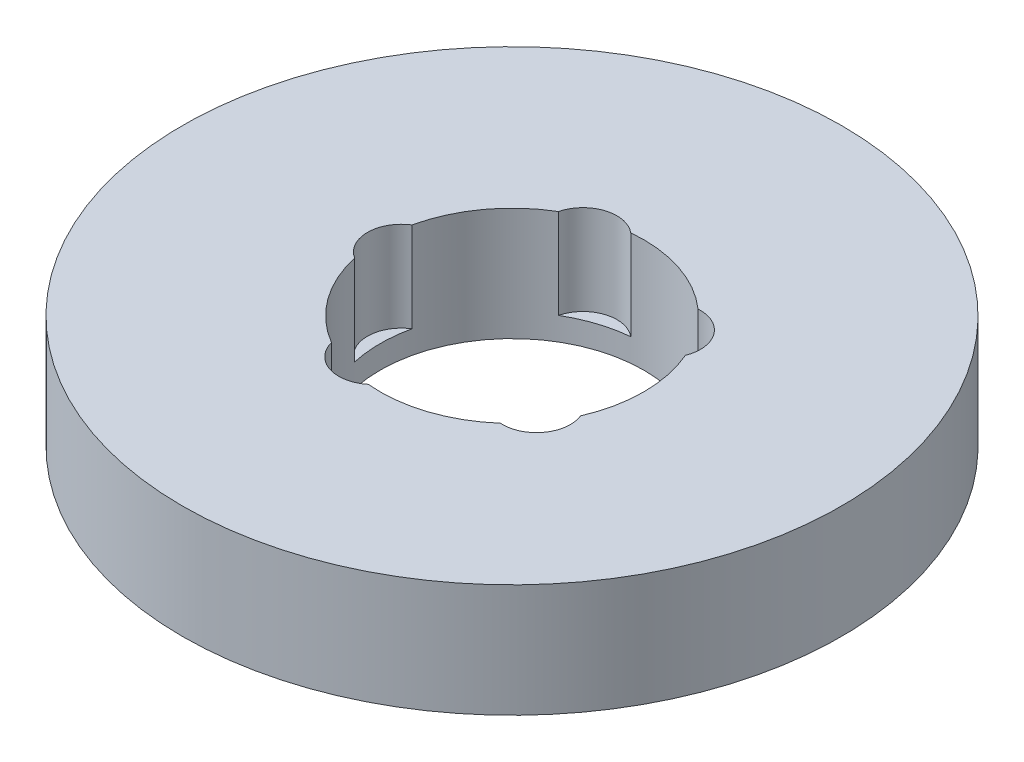
ISO-10303-21;
HEADER;
FILE_DESCRIPTION(('STEP AP214'),'2;1');
FILE_NAME('part.step','',(''),(''),'','','');
FILE_SCHEMA(('AUTOMOTIVE_DESIGN { 1 0 10303 214 1 1 1 1 }'));
ENDSEC;
DATA;
#1=APPLICATION_CONTEXT('core data for automotive mechanical design processes');
#2=APPLICATION_PROTOCOL_DEFINITION('international standard','automotive_design',2000,#1);
#3=PRODUCT_CONTEXT('',#1,'mechanical');
#4=PRODUCT('Part','Part','',(#3));
#5=PRODUCT_RELATED_PRODUCT_CATEGORY('part','',(#4));
#6=PRODUCT_DEFINITION_FORMATION('','',#4);
#7=PRODUCT_DEFINITION_CONTEXT('part definition',#1,'design');
#8=PRODUCT_DEFINITION('design','',#6,#7);
#9=PRODUCT_DEFINITION_SHAPE('','',#8);
#10=(LENGTH_UNIT() NAMED_UNIT(*) SI_UNIT(.MILLI.,.METRE.));
#11=(NAMED_UNIT(*) PLANE_ANGLE_UNIT() SI_UNIT($,.RADIAN.));
#12=(NAMED_UNIT(*) SI_UNIT($,.STERADIAN.) SOLID_ANGLE_UNIT());
#13=UNCERTAINTY_MEASURE_WITH_UNIT(LENGTH_MEASURE(1.E-05),#10,'distance_accuracy_value','');
#14=(GEOMETRIC_REPRESENTATION_CONTEXT(3) GLOBAL_UNCERTAINTY_ASSIGNED_CONTEXT((#13)) GLOBAL_UNIT_ASSIGNED_CONTEXT((#10,
#11,#12)) REPRESENTATION_CONTEXT('',''));
#15=CARTESIAN_POINT('',(0.,0.,0.));
#16=DIRECTION('',(0.,0.,1.));
#17=DIRECTION('',(1.,0.,0.));
#18=AXIS2_PLACEMENT_3D('',#15,#16,#17);
#19=CARTESIAN_POINT('',(0.,30.,0.));
#20=DIRECTION('',(0.,-1.,0.));
#21=DIRECTION('',(0.,0.,-1.));
#22=AXIS2_PLACEMENT_3D('',#19,#20,#21);
#23=CYLINDRICAL_SURFACE('',#22,87.5);
#24=CARTESIAN_POINT('',(0.,30.,0.));
#25=DIRECTION('',(0.,1.,0.));
#26=DIRECTION('',(0.,0.,1.));
#27=AXIS2_PLACEMENT_3D('',#24,#25,#26);
#28=CIRCLE('',#27,87.5);
#29=CARTESIAN_POINT('',(0.,30.,87.5));
#30=VERTEX_POINT('',#29);
#31=EDGE_CURVE('E151',#30,#30,#28,.T.);
#32=ORIENTED_EDGE('',*,*,#31,.F.);
#33=EDGE_LOOP('',(#32));
#34=FACE_BOUND('',#33,.T.);
#35=CARTESIAN_POINT('',(0.,0.,0.));
#36=DIRECTION('',(0.,1.,0.));
#37=DIRECTION('',(0.,0.,1.));
#38=AXIS2_PLACEMENT_3D('',#35,#36,#37);
#39=CIRCLE('',#38,87.5);
#40=CARTESIAN_POINT('',(0.,0.,87.5));
#41=VERTEX_POINT('',#40);
#42=EDGE_CURVE('E150',#41,#41,#39,.T.);
#43=ORIENTED_EDGE('',*,*,#42,.T.);
#44=EDGE_LOOP('',(#43));
#45=FACE_BOUND('',#44,.T.);
#46=ADVANCED_FACE('F39',(#34,#45),#23,.T.);
#47=CARTESIAN_POINT('',(0.,30.,0.));
#48=DIRECTION('',(0.,1.,0.));
#49=DIRECTION('',(0.,0.,1.));
#50=AXIS2_PLACEMENT_3D('',#47,#48,#49);
#51=PLANE('',#50);
#52=CARTESIAN_POINT('',(-9.07555263022576,30.,-27.9316789208123));
#53=DIRECTION('',(0.,1.,0.));
#54=DIRECTION('',(-0.95105651629515,0.,0.309016994374958));
#55=AXIS2_PLACEMENT_3D('',#52,#53,#54);
#56=CIRCLE('',#55,8.99838053236741);
#57=CARTESIAN_POINT('',(-3.31303220908564,30.,-34.8428445678817));
#58=VERTEX_POINT('',#57);
#59=CARTESIAN_POINT('',(-17.7998108248586,30.,-30.1358048606512));
#60=VERTEX_POINT('',#59);
#61=EDGE_CURVE('E196',#58,#60,#56,.T.);
#62=ORIENTED_EDGE('',*,*,#61,.F.);
#63=CARTESIAN_POINT('',(0.,30.,0.));
#64=DIRECTION('',(0.,1.,0.));
#65=DIRECTION('',(0.,0.,1.));
#66=AXIS2_PLACEMENT_3D('',#63,#64,#65);
#67=CIRCLE('',#66,35.);
#68=CARTESIAN_POINT('',(23.1604095449811,30.,-26.2411019149111));
#69=VERTEX_POINT('',#68);
#70=EDGE_CURVE('E156',#69,#58,#67,.T.);
#71=ORIENTED_EDGE('',*,*,#70,.F.);
#72=CARTESIAN_POINT('',(23.7601052526186,30.,-17.2627269359113));
#73=DIRECTION('',(0.,1.,0.));
#74=DIRECTION('',(-0.58778525229248,0.,-0.809016994374942));
#75=AXIS2_PLACEMENT_3D('',#72,#73,#74);
#76=CIRCLE('',#75,8.99838053236741);
#77=CARTESIAN_POINT('',(32.1137311170241,30.,-13.9179119749868));
#78=VERTEX_POINT('',#77);
#79=EDGE_CURVE('E254',#78,#69,#76,.T.);
#80=ORIENTED_EDGE('',*,*,#79,.F.);
#81=CARTESIAN_POINT('',(32.1137311170243,30.,13.9179119749863));
#82=VERTEX_POINT('',#81);
#83=EDGE_CURVE('E153',#82,#78,#67,.T.);
#84=ORIENTED_EDGE('',*,*,#83,.F.);
#85=CARTESIAN_POINT('',(23.7601052526188,30.,17.2627269359109));
#86=DIRECTION('',(0.,1.,0.));
#87=DIRECTION('',(0.587785252292469,0.,-0.809016994374951));
#88=AXIS2_PLACEMENT_3D('',#85,#86,#87);
#89=CIRCLE('',#88,8.99838053236741);
#90=CARTESIAN_POINT('',(23.1604095449815,30.,26.2411019149107));
#91=VERTEX_POINT('',#90);
#92=EDGE_CURVE('E248',#91,#82,#89,.T.);
#93=ORIENTED_EDGE('',*,*,#92,.F.);
#94=CARTESIAN_POINT('',(-3.31303220908514,30.,34.8428445678817));
#95=VERTEX_POINT('',#94);
#96=EDGE_CURVE('E140',#95,#91,#67,.T.);
#97=ORIENTED_EDGE('',*,*,#96,.F.);
#98=CARTESIAN_POINT('',(-9.07555263022536,30.,27.9316789208124));
#99=DIRECTION('',(0.,1.,0.));
#100=DIRECTION('',(0.951056516295155,0.,0.309016994374945));
#101=AXIS2_PLACEMENT_3D('',#98,#99,#100);
#102=CIRCLE('',#101,8.99838053236741);
#103=CARTESIAN_POINT('',(-17.7998108248582,30.,30.1358048606514));
#104=VERTEX_POINT('',#103);
#105=EDGE_CURVE('E117',#104,#95,#102,.T.);
#106=ORIENTED_EDGE('',*,*,#105,.F.);
#107=CARTESIAN_POINT('',(-34.161297628062,30.,7.61615023269402));
#108=VERTEX_POINT('',#107);
#109=EDGE_CURVE('E133',#108,#104,#67,.T.);
#110=ORIENTED_EDGE('',*,*,#109,.F.);
#111=CARTESIAN_POINT('',(-29.3691052447865,30.,0.));
#112=DIRECTION('',(0.,1.,0.));
#113=DIRECTION('',(0.,0.,1.));
#114=AXIS2_PLACEMENT_3D('',#111,#112,#113);
#115=CIRCLE('',#114,8.99838053236741);
#116=CARTESIAN_POINT('',(-34.161297628062,30.,-7.61615023269402));
#117=VERTEX_POINT('',#116);
#118=EDGE_CURVE('E170',#117,#108,#115,.T.);
#119=ORIENTED_EDGE('',*,*,#118,.F.);
#120=EDGE_CURVE('E149',#60,#117,#67,.T.);
#121=ORIENTED_EDGE('',*,*,#120,.F.);
#122=EDGE_LOOP('',(#62,#71,#80,#84,#93,#97,#106,#110,#119,#121));
#123=FACE_BOUND('',#122,.T.);
#124=ORIENTED_EDGE('',*,*,#31,.T.);
#125=EDGE_LOOP('',(#124));
#126=FACE_BOUND('',#125,.T.);
#127=ADVANCED_FACE('F131',(#123,#126),#51,.T.);
#128=CARTESIAN_POINT('',(0.,0.,0.));
#129=DIRECTION('',(0.,1.,0.));
#130=DIRECTION('',(0.,0.,1.));
#131=AXIS2_PLACEMENT_3D('',#128,#129,#130);
#132=PLANE('',#131);
#133=CARTESIAN_POINT('',(0.,0.,0.));
#134=DIRECTION('',(0.,1.,0.));
#135=DIRECTION('',(0.,0.,1.));
#136=AXIS2_PLACEMENT_3D('',#133,#134,#135);
#137=CIRCLE('',#136,35.);
#138=CARTESIAN_POINT('',(0.,0.,35.));
#139=VERTEX_POINT('',#138);
#140=EDGE_CURVE('E160',#139,#139,#137,.T.);
#141=ORIENTED_EDGE('',*,*,#140,.T.);
#142=EDGE_LOOP('',(#141));
#143=FACE_BOUND('',#142,.T.);
#144=ORIENTED_EDGE('',*,*,#42,.F.);
#145=EDGE_LOOP('',(#144));
#146=FACE_BOUND('',#145,.T.);
#147=ADVANCED_FACE('F212',(#143,#146),#132,.F.);
#148=CARTESIAN_POINT('',(0.,30.,0.));
#149=DIRECTION('',(0.,-1.,0.));
#150=DIRECTION('',(0.,0.,-1.));
#151=AXIS2_PLACEMENT_3D('',#148,#149,#150);
#152=CYLINDRICAL_SURFACE('',#151,35.);
#153=DIRECTION('',(0.,1.,0.));
#154=VECTOR('',#153,1.);
#155=CARTESIAN_POINT('',(-3.31303220908565,18.057680204193,-34.8428445678817));
#156=LINE('',#155,#154);
#157=CARTESIAN_POINT('',(-3.31303220908564,6.11536040838591,-34.8428445678817));
#158=VERTEX_POINT('',#157);
#159=EDGE_CURVE('E11',#158,#58,#156,.T.);
#160=ORIENTED_EDGE('',*,*,#159,.F.);
#161=CARTESIAN_POINT('',(0.,6.11536040838591,0.));
#162=DIRECTION('',(0.,1.,0.));
#163=DIRECTION('',(0.,0.,1.));
#164=AXIS2_PLACEMENT_3D('',#161,#162,#163);
#165=CIRCLE('',#164,35.);
#166=CARTESIAN_POINT('',(-17.7998108248586,6.11536040838591,-30.1358048606512));
#167=VERTEX_POINT('',#166);
#168=EDGE_CURVE('E193',#158,#167,#165,.T.);
#169=ORIENTED_EDGE('',*,*,#168,.T.);
#170=DIRECTION('',(0.,1.,0.));
#171=VECTOR('',#170,1.);
#172=CARTESIAN_POINT('',(-17.7998108248586,18.057680204193,-30.1358048606512));
#173=LINE('',#172,#171);
#174=EDGE_CURVE('E46',#60,#167,#173,.F.);
#175=ORIENTED_EDGE('',*,*,#174,.F.);
#176=ORIENTED_EDGE('',*,*,#120,.T.);
#177=DIRECTION('',(0.,1.,0.));
#178=VECTOR('',#177,1.);
#179=CARTESIAN_POINT('',(-34.161297628062,18.057680204193,-7.61615023269401));
#180=LINE('',#179,#178);
#181=CARTESIAN_POINT('',(-34.161297628062,6.11536040838591,-7.61615023269402));
#182=VERTEX_POINT('',#181);
#183=EDGE_CURVE('E174',#182,#117,#180,.T.);
#184=ORIENTED_EDGE('',*,*,#183,.F.);
#185=CARTESIAN_POINT('',(0.,6.11536040838591,0.));
#186=DIRECTION('',(0.,1.,0.));
#187=DIRECTION('',(0.,0.,1.));
#188=AXIS2_PLACEMENT_3D('',#185,#186,#187);
#189=CIRCLE('',#188,35.);
#190=CARTESIAN_POINT('',(-34.161297628062,6.11536040838591,7.61615023269402));
#191=VERTEX_POINT('',#190);
#192=EDGE_CURVE('E171',#182,#191,#189,.T.);
#193=ORIENTED_EDGE('',*,*,#192,.T.);
#194=DIRECTION('',(0.,1.,0.));
#195=VECTOR('',#194,1.);
#196=CARTESIAN_POINT('',(-34.161297628062,18.057680204193,7.61615023269401));
#197=LINE('',#196,#195);
#198=EDGE_CURVE('E148',#108,#191,#197,.F.);
#199=ORIENTED_EDGE('',*,*,#198,.F.);
#200=ORIENTED_EDGE('',*,*,#109,.T.);
#201=DIRECTION('',(0.,1.,0.));
#202=VECTOR('',#201,1.);
#203=CARTESIAN_POINT('',(-17.7998108248582,18.057680204193,30.1358048606514));
#204=LINE('',#203,#202);
#205=CARTESIAN_POINT('',(-17.7998108248582,6.11536040838591,30.1358048606514));
#206=VERTEX_POINT('',#205);
#207=EDGE_CURVE('E111',#206,#104,#204,.T.);
#208=ORIENTED_EDGE('',*,*,#207,.F.);
#209=CARTESIAN_POINT('',(0.,6.11536040838591,0.));
#210=DIRECTION('',(0.,1.,0.));
#211=DIRECTION('',(0.,0.,1.));
#212=AXIS2_PLACEMENT_3D('',#209,#210,#211);
#213=CIRCLE('',#212,35.);
#214=CARTESIAN_POINT('',(-3.31303220908514,6.11536040838591,34.8428445678817));
#215=VERTEX_POINT('',#214);
#216=EDGE_CURVE('E180',#206,#215,#213,.T.);
#217=ORIENTED_EDGE('',*,*,#216,.T.);
#218=DIRECTION('',(0.,1.,0.));
#219=VECTOR('',#218,1.);
#220=CARTESIAN_POINT('',(-3.31303220908514,18.057680204193,34.8428445678817));
#221=LINE('',#220,#219);
#222=EDGE_CURVE('E124',#95,#215,#221,.F.);
#223=ORIENTED_EDGE('',*,*,#222,.F.);
#224=ORIENTED_EDGE('',*,*,#96,.T.);
#225=DIRECTION('',(0.,1.,0.));
#226=VECTOR('',#225,1.);
#227=CARTESIAN_POINT('',(23.1604095449815,18.057680204193,26.2411019149107));
#228=LINE('',#227,#226);
#229=CARTESIAN_POINT('',(23.1604095449815,6.11536040838591,26.2411019149107));
#230=VERTEX_POINT('',#229);
#231=EDGE_CURVE('E183',#230,#91,#228,.T.);
#232=ORIENTED_EDGE('',*,*,#231,.F.);
#233=CARTESIAN_POINT('',(0.,6.11536040838591,0.));
#234=DIRECTION('',(0.,1.,0.));
#235=DIRECTION('',(0.,0.,1.));
#236=AXIS2_PLACEMENT_3D('',#233,#234,#235);
#237=CIRCLE('',#236,35.);
#238=CARTESIAN_POINT('',(32.1137311170243,6.11536040838591,13.9179119749863));
#239=VERTEX_POINT('',#238);
#240=EDGE_CURVE('E123',#230,#239,#237,.T.);
#241=ORIENTED_EDGE('',*,*,#240,.T.);
#242=DIRECTION('',(0.,1.,0.));
#243=VECTOR('',#242,1.);
#244=CARTESIAN_POINT('',(32.1137311170243,18.057680204193,13.9179119749864));
#245=LINE('',#244,#243);
#246=EDGE_CURVE('E185',#82,#239,#245,.F.);
#247=ORIENTED_EDGE('',*,*,#246,.F.);
#248=ORIENTED_EDGE('',*,*,#83,.T.);
#249=DIRECTION('',(0.,1.,0.));
#250=VECTOR('',#249,1.);
#251=CARTESIAN_POINT('',(32.1137311170241,18.057680204193,-13.9179119749868));
#252=LINE('',#251,#250);
#253=CARTESIAN_POINT('',(32.1137311170241,6.11536040838591,-13.9179119749868));
#254=VERTEX_POINT('',#253);
#255=EDGE_CURVE('E195',#254,#78,#252,.T.);
#256=ORIENTED_EDGE('',*,*,#255,.F.);
#257=CARTESIAN_POINT('',(0.,6.11536040838591,0.));
#258=DIRECTION('',(0.,1.,0.));
#259=DIRECTION('',(0.,0.,1.));
#260=AXIS2_PLACEMENT_3D('',#257,#258,#259);
#261=CIRCLE('',#260,35.);
#262=CARTESIAN_POINT('',(23.1604095449811,6.11536040838591,-26.2411019149111));
#263=VERTEX_POINT('',#262);
#264=EDGE_CURVE('E190',#254,#263,#261,.T.);
#265=ORIENTED_EDGE('',*,*,#264,.T.);
#266=DIRECTION('',(0.,1.,0.));
#267=VECTOR('',#266,1.);
#268=CARTESIAN_POINT('',(23.1604095449811,18.057680204193,-26.2411019149111));
#269=LINE('',#268,#267);
#270=EDGE_CURVE('E189',#69,#263,#269,.F.);
#271=ORIENTED_EDGE('',*,*,#270,.F.);
#272=ORIENTED_EDGE('',*,*,#70,.T.);
#273=EDGE_LOOP('',(#160,#169,#175,#176,#184,#193,#199,#200,#208,#217,#223,#224,#232,#241,#247,
#248,#256,#265,#271,#272));
#274=FACE_BOUND('',#273,.T.);
#275=ORIENTED_EDGE('',*,*,#140,.F.);
#276=EDGE_LOOP('',(#275));
#277=FACE_BOUND('',#276,.T.);
#278=ADVANCED_FACE('F142',(#274,#277),#152,.F.);
#279=CARTESIAN_POINT('',(-29.3691052447865,6.11536040838591,0.));
#280=DIRECTION('',(0.,1.,0.));
#281=DIRECTION('',(0.,0.,1.));
#282=AXIS2_PLACEMENT_3D('',#279,#280,#281);
#283=CYLINDRICAL_SURFACE('',#282,8.99838053236741);
#284=ORIENTED_EDGE('',*,*,#183,.T.);
#285=ORIENTED_EDGE('',*,*,#118,.T.);
#286=ORIENTED_EDGE('',*,*,#198,.T.);
#287=CARTESIAN_POINT('',(-29.3691052447865,6.11536040838591,0.));
#288=DIRECTION('',(0.,1.,0.));
#289=DIRECTION('',(0.,0.,1.));
#290=AXIS2_PLACEMENT_3D('',#287,#288,#289);
#291=CIRCLE('',#290,8.99838053236741);
#292=EDGE_CURVE('E163',#182,#191,#291,.T.);
#293=ORIENTED_EDGE('',*,*,#292,.F.);
#294=EDGE_LOOP('',(#284,#285,#286,#293));
#295=FACE_BOUND('',#294,.T.);
#296=ADVANCED_FACE('F221',(#295),#283,.F.);
#297=CARTESIAN_POINT('',(-29.3691052447865,6.11536040838591,0.));
#298=DIRECTION('',(0.,1.,0.));
#299=DIRECTION('',(0.,0.,1.));
#300=AXIS2_PLACEMENT_3D('',#297,#298,#299);
#301=PLANE('',#300);
#302=ORIENTED_EDGE('',*,*,#292,.T.);
#303=ORIENTED_EDGE('',*,*,#192,.F.);
#304=EDGE_LOOP('',(#302,#303));
#305=FACE_BOUND('',#304,.T.);
#306=ADVANCED_FACE('F227',(#305),#301,.T.);
#307=CARTESIAN_POINT('',(-9.07555263022536,6.11536040838591,27.9316789208124));
#308=DIRECTION('',(0.,1.,0.));
#309=DIRECTION('',(0.,0.,1.));
#310=AXIS2_PLACEMENT_3D('',#307,#308,#309);
#311=CYLINDRICAL_SURFACE('',#310,8.99838053236741);
#312=ORIENTED_EDGE('',*,*,#207,.T.);
#313=ORIENTED_EDGE('',*,*,#105,.T.);
#314=ORIENTED_EDGE('',*,*,#222,.T.);
#315=CARTESIAN_POINT('',(-9.07555263022536,6.11536040838591,27.9316789208124));
#316=DIRECTION('',(0.,1.,0.));
#317=DIRECTION('',(0.951056516295155,0.,0.309016994374945));
#318=AXIS2_PLACEMENT_3D('',#315,#316,#317);
#319=CIRCLE('',#318,8.99838053236741);
#320=EDGE_CURVE('E119',#206,#215,#319,.T.);
#321=ORIENTED_EDGE('',*,*,#320,.F.);
#322=EDGE_LOOP('',(#312,#313,#314,#321));
#323=FACE_BOUND('',#322,.T.);
#324=ADVANCED_FACE('F116',(#323),#311,.F.);
#325=CARTESIAN_POINT('',(-9.07555263022536,6.11536040838591,27.9316789208124));
#326=DIRECTION('',(0.,1.,0.));
#327=DIRECTION('',(0.951056516295155,0.,0.309016994374945));
#328=AXIS2_PLACEMENT_3D('',#325,#326,#327);
#329=PLANE('',#328);
#330=ORIENTED_EDGE('',*,*,#320,.T.);
#331=ORIENTED_EDGE('',*,*,#216,.F.);
#332=EDGE_LOOP('',(#330,#331));
#333=FACE_BOUND('',#332,.T.);
#334=ADVANCED_FACE('F234',(#333),#329,.T.);
#335=CARTESIAN_POINT('',(23.7601052526188,6.11536040838591,17.2627269359109));
#336=DIRECTION('',(0.,1.,0.));
#337=DIRECTION('',(0.,0.,1.));
#338=AXIS2_PLACEMENT_3D('',#335,#336,#337);
#339=CYLINDRICAL_SURFACE('',#338,8.99838053236741);
#340=ORIENTED_EDGE('',*,*,#231,.T.);
#341=ORIENTED_EDGE('',*,*,#92,.T.);
#342=ORIENTED_EDGE('',*,*,#246,.T.);
#343=CARTESIAN_POINT('',(23.7601052526188,6.11536040838591,17.2627269359109));
#344=DIRECTION('',(0.,1.,0.));
#345=DIRECTION('',(0.587785252292469,0.,-0.809016994374951));
#346=AXIS2_PLACEMENT_3D('',#343,#344,#345);
#347=CIRCLE('',#346,8.99838053236741);
#348=EDGE_CURVE('E137',#230,#239,#347,.T.);
#349=ORIENTED_EDGE('',*,*,#348,.F.);
#350=EDGE_LOOP('',(#340,#341,#342,#349));
#351=FACE_BOUND('',#350,.T.);
#352=ADVANCED_FACE('F240',(#351),#339,.F.);
#353=CARTESIAN_POINT('',(23.7601052526188,6.11536040838591,17.2627269359109));
#354=DIRECTION('',(0.,1.,0.));
#355=DIRECTION('',(0.587785252292469,0.,-0.809016994374951));
#356=AXIS2_PLACEMENT_3D('',#353,#354,#355);
#357=PLANE('',#356);
#358=ORIENTED_EDGE('',*,*,#348,.T.);
#359=ORIENTED_EDGE('',*,*,#240,.F.);
#360=EDGE_LOOP('',(#358,#359));
#361=FACE_BOUND('',#360,.T.);
#362=ADVANCED_FACE('F245',(#361),#357,.T.);
#363=CARTESIAN_POINT('',(23.7601052526186,6.11536040838591,-17.2627269359113));
#364=DIRECTION('',(0.,1.,0.));
#365=DIRECTION('',(0.,0.,1.));
#366=AXIS2_PLACEMENT_3D('',#363,#364,#365);
#367=CYLINDRICAL_SURFACE('',#366,8.99838053236741);
#368=ORIENTED_EDGE('',*,*,#255,.T.);
#369=ORIENTED_EDGE('',*,*,#79,.T.);
#370=ORIENTED_EDGE('',*,*,#270,.T.);
#371=CARTESIAN_POINT('',(23.7601052526186,6.11536040838591,-17.2627269359113));
#372=DIRECTION('',(0.,1.,0.));
#373=DIRECTION('',(-0.58778525229248,0.,-0.809016994374942));
#374=AXIS2_PLACEMENT_3D('',#371,#372,#373);
#375=CIRCLE('',#374,8.99838053236741);
#376=EDGE_CURVE('E56',#254,#263,#375,.T.);
#377=ORIENTED_EDGE('',*,*,#376,.F.);
#378=EDGE_LOOP('',(#368,#369,#370,#377));
#379=FACE_BOUND('',#378,.T.);
#380=ADVANCED_FACE('F264',(#379),#367,.F.);
#381=CARTESIAN_POINT('',(23.7601052526186,6.11536040838591,-17.2627269359113));
#382=DIRECTION('',(0.,1.,0.));
#383=DIRECTION('',(-0.58778525229248,0.,-0.809016994374942));
#384=AXIS2_PLACEMENT_3D('',#381,#382,#383);
#385=PLANE('',#384);
#386=ORIENTED_EDGE('',*,*,#376,.T.);
#387=ORIENTED_EDGE('',*,*,#264,.F.);
#388=EDGE_LOOP('',(#386,#387));
#389=FACE_BOUND('',#388,.T.);
#390=ADVANCED_FACE('F202',(#389),#385,.T.);
#391=CARTESIAN_POINT('',(-9.07555263022576,6.11536040838591,-27.9316789208123));
#392=DIRECTION('',(0.,1.,0.));
#393=DIRECTION('',(0.,0.,1.));
#394=AXIS2_PLACEMENT_3D('',#391,#392,#393);
#395=CYLINDRICAL_SURFACE('',#394,8.99838053236741);
#396=ORIENTED_EDGE('',*,*,#159,.T.);
#397=ORIENTED_EDGE('',*,*,#61,.T.);
#398=ORIENTED_EDGE('',*,*,#174,.T.);
#399=CARTESIAN_POINT('',(-9.07555263022576,6.11536040838591,-27.9316789208123));
#400=DIRECTION('',(0.,1.,0.));
#401=DIRECTION('',(-0.95105651629515,0.,0.309016994374958));
#402=AXIS2_PLACEMENT_3D('',#399,#400,#401);
#403=CIRCLE('',#402,8.99838053236741);
#404=EDGE_CURVE('E55',#158,#167,#403,.T.);
#405=ORIENTED_EDGE('',*,*,#404,.F.);
#406=EDGE_LOOP('',(#396,#397,#398,#405));
#407=FACE_BOUND('',#406,.T.);
#408=ADVANCED_FACE('F197',(#407),#395,.F.);
#409=CARTESIAN_POINT('',(-9.07555263022576,6.11536040838591,-27.9316789208123));
#410=DIRECTION('',(0.,1.,0.));
#411=DIRECTION('',(-0.95105651629515,0.,0.309016994374958));
#412=AXIS2_PLACEMENT_3D('',#409,#410,#411);
#413=PLANE('',#412);
#414=ORIENTED_EDGE('',*,*,#404,.T.);
#415=ORIENTED_EDGE('',*,*,#168,.F.);
#416=EDGE_LOOP('',(#414,#415));
#417=FACE_BOUND('',#416,.T.);
#418=ADVANCED_FACE('F200',(#417),#413,.T.);
#419=CLOSED_SHELL('',(#46,#127,#147,#278,#296,#306,#324,#334,#352,#362,#380,#390,#408,#418));
#420=MANIFOLD_SOLID_BREP('B2',#419);
#421=ADVANCED_BREP_SHAPE_REPRESENTATION('',(#18,#420),#14);
#422=SHAPE_DEFINITION_REPRESENTATION(#9,#421);
ENDSEC;
END-ISO-10303-21;
